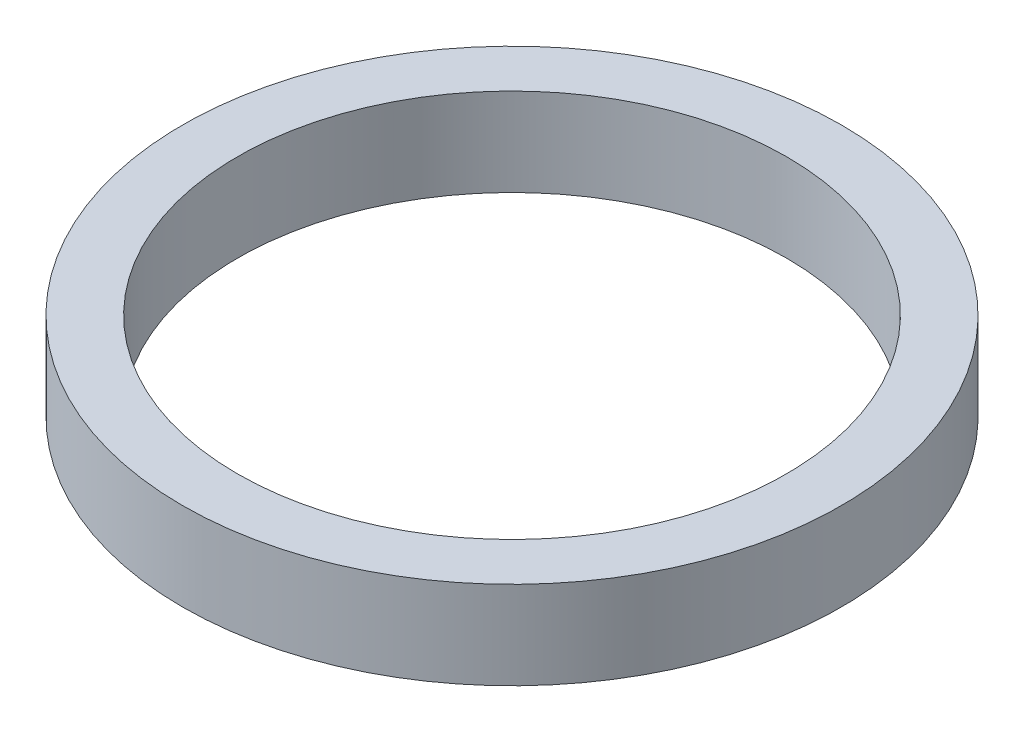
ISO-10303-21;
HEADER;
FILE_DESCRIPTION(('STEP AP214'),'2;1');
FILE_NAME('part.step','',(''),(''),'','','');
FILE_SCHEMA(('AUTOMOTIVE_DESIGN { 1 0 10303 214 1 1 1 1 }'));
ENDSEC;
DATA;
#1=APPLICATION_CONTEXT('core data for automotive mechanical design processes');
#2=APPLICATION_PROTOCOL_DEFINITION('international standard','automotive_design',2000,#1);
#3=PRODUCT_CONTEXT('',#1,'mechanical');
#4=PRODUCT('Part','Part','',(#3));
#5=PRODUCT_RELATED_PRODUCT_CATEGORY('part','',(#4));
#6=PRODUCT_DEFINITION_FORMATION('','',#4);
#7=PRODUCT_DEFINITION_CONTEXT('part definition',#1,'design');
#8=PRODUCT_DEFINITION('design','',#6,#7);
#9=PRODUCT_DEFINITION_SHAPE('','',#8);
#10=(LENGTH_UNIT() NAMED_UNIT(*) SI_UNIT(.MILLI.,.METRE.));
#11=(NAMED_UNIT(*) PLANE_ANGLE_UNIT() SI_UNIT($,.RADIAN.));
#12=(NAMED_UNIT(*) SI_UNIT($,.STERADIAN.) SOLID_ANGLE_UNIT());
#13=UNCERTAINTY_MEASURE_WITH_UNIT(LENGTH_MEASURE(1.E-05),#10,'distance_accuracy_value','');
#14=(GEOMETRIC_REPRESENTATION_CONTEXT(3) GLOBAL_UNCERTAINTY_ASSIGNED_CONTEXT((#13)) GLOBAL_UNIT_ASSIGNED_CONTEXT((#10,
#11,#12)) REPRESENTATION_CONTEXT('',''));
#15=CARTESIAN_POINT('',(0.,0.,0.));
#16=DIRECTION('',(0.,0.,1.));
#17=DIRECTION('',(1.,0.,0.));
#18=AXIS2_PLACEMENT_3D('',#15,#16,#17);
#19=CARTESIAN_POINT('',(0.,16.,0.));
#20=DIRECTION('',(0.,-1.,0.));
#21=DIRECTION('',(0.,0.,-1.));
#22=AXIS2_PLACEMENT_3D('',#19,#20,#21);
#23=CYLINDRICAL_SURFACE('',#22,60.);
#24=CARTESIAN_POINT('',(0.,16.,0.));
#25=DIRECTION('',(0.,1.,0.));
#26=DIRECTION('',(0.,0.,1.));
#27=AXIS2_PLACEMENT_3D('',#24,#25,#26);
#28=CIRCLE('',#27,60.);
#29=CARTESIAN_POINT('',(0.,16.,60.));
#30=VERTEX_POINT('',#29);
#31=EDGE_CURVE('E10',#30,#30,#28,.T.);
#32=ORIENTED_EDGE('',*,*,#31,.F.);
#33=EDGE_LOOP('',(#32));
#34=FACE_BOUND('',#33,.T.);
#35=CARTESIAN_POINT('',(0.,0.,0.));
#36=DIRECTION('',(0.,1.,0.));
#37=DIRECTION('',(0.,0.,1.));
#38=AXIS2_PLACEMENT_3D('',#35,#36,#37);
#39=CIRCLE('',#38,60.);
#40=CARTESIAN_POINT('',(0.,0.,60.));
#41=VERTEX_POINT('',#40);
#42=EDGE_CURVE('E37',#41,#41,#39,.T.);
#43=ORIENTED_EDGE('',*,*,#42,.T.);
#44=EDGE_LOOP('',(#43));
#45=FACE_BOUND('',#44,.T.);
#46=ADVANCED_FACE('F40',(#34,#45),#23,.T.);
#47=CARTESIAN_POINT('',(0.,16.,0.));
#48=DIRECTION('',(0.,1.,0.));
#49=DIRECTION('',(0.,0.,1.));
#50=AXIS2_PLACEMENT_3D('',#47,#48,#49);
#51=PLANE('',#50);
#52=CARTESIAN_POINT('',(0.,16.,0.));
#53=DIRECTION('',(0.,1.,0.));
#54=DIRECTION('',(0.,0.,1.));
#55=AXIS2_PLACEMENT_3D('',#52,#53,#54);
#56=CIRCLE('',#55,50.);
#57=CARTESIAN_POINT('',(0.,16.,50.));
#58=VERTEX_POINT('',#57);
#59=EDGE_CURVE('E50',#58,#58,#56,.T.);
#60=ORIENTED_EDGE('',*,*,#59,.F.);
#61=EDGE_LOOP('',(#60));
#62=FACE_BOUND('',#61,.T.);
#63=ORIENTED_EDGE('',*,*,#31,.T.);
#64=EDGE_LOOP('',(#63));
#65=FACE_BOUND('',#64,.T.);
#66=ADVANCED_FACE('F59',(#62,#65),#51,.T.);
#67=CARTESIAN_POINT('',(0.,0.,0.));
#68=DIRECTION('',(0.,1.,0.));
#69=DIRECTION('',(0.,0.,1.));
#70=AXIS2_PLACEMENT_3D('',#67,#68,#69);
#71=PLANE('',#70);
#72=CARTESIAN_POINT('',(0.,0.,0.));
#73=DIRECTION('',(0.,1.,0.));
#74=DIRECTION('',(0.,0.,1.));
#75=AXIS2_PLACEMENT_3D('',#72,#73,#74);
#76=CIRCLE('',#75,50.);
#77=CARTESIAN_POINT('',(0.,0.,50.));
#78=VERTEX_POINT('',#77);
#79=EDGE_CURVE('E47',#78,#78,#76,.T.);
#80=ORIENTED_EDGE('',*,*,#79,.T.);
#81=EDGE_LOOP('',(#80));
#82=FACE_BOUND('',#81,.T.);
#83=ORIENTED_EDGE('',*,*,#42,.F.);
#84=EDGE_LOOP('',(#83));
#85=FACE_BOUND('',#84,.T.);
#86=ADVANCED_FACE('F58',(#82,#85),#71,.F.);
#87=CARTESIAN_POINT('',(0.,16.,0.));
#88=DIRECTION('',(0.,-1.,0.));
#89=DIRECTION('',(0.,0.,-1.));
#90=AXIS2_PLACEMENT_3D('',#87,#88,#89);
#91=CYLINDRICAL_SURFACE('',#90,50.);
#92=ORIENTED_EDGE('',*,*,#59,.T.);
#93=EDGE_LOOP('',(#92));
#94=FACE_BOUND('',#93,.T.);
#95=ORIENTED_EDGE('',*,*,#79,.F.);
#96=EDGE_LOOP('',(#95));
#97=FACE_BOUND('',#96,.T.);
#98=ADVANCED_FACE('F54',(#94,#97),#91,.F.);
#99=CLOSED_SHELL('',(#46,#66,#86,#98));
#100=MANIFOLD_SOLID_BREP('B2',#99);
#101=ADVANCED_BREP_SHAPE_REPRESENTATION('',(#18,#100),#14);
#102=SHAPE_DEFINITION_REPRESENTATION(#9,#101);
ENDSEC;
END-ISO-10303-21;
